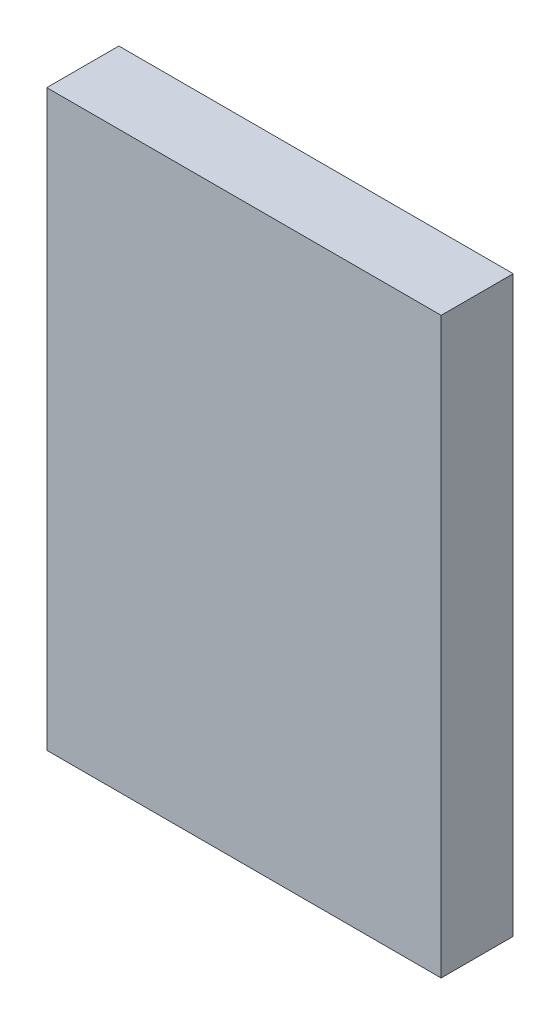
ISO-10303-21;
HEADER;
FILE_DESCRIPTION(('STEP AP214'),'2;1');
FILE_NAME('part.step','',(''),(''),'','','');
FILE_SCHEMA(('AUTOMOTIVE_DESIGN { 1 0 10303 214 1 1 1 1 }'));
ENDSEC;
DATA;
#1=APPLICATION_CONTEXT('core data for automotive mechanical design processes');
#2=APPLICATION_PROTOCOL_DEFINITION('international standard','automotive_design',2000,#1);
#3=PRODUCT_CONTEXT('',#1,'mechanical');
#4=PRODUCT('Part','Part','',(#3));
#5=PRODUCT_RELATED_PRODUCT_CATEGORY('part','',(#4));
#6=PRODUCT_DEFINITION_FORMATION('','',#4);
#7=PRODUCT_DEFINITION_CONTEXT('part definition',#1,'design');
#8=PRODUCT_DEFINITION('design','',#6,#7);
#9=PRODUCT_DEFINITION_SHAPE('','',#8);
#10=(LENGTH_UNIT() NAMED_UNIT(*) SI_UNIT(.MILLI.,.METRE.));
#11=(NAMED_UNIT(*) PLANE_ANGLE_UNIT() SI_UNIT($,.RADIAN.));
#12=(NAMED_UNIT(*) SI_UNIT($,.STERADIAN.) SOLID_ANGLE_UNIT());
#13=UNCERTAINTY_MEASURE_WITH_UNIT(LENGTH_MEASURE(1.E-05),#10,'distance_accuracy_value','');
#14=(GEOMETRIC_REPRESENTATION_CONTEXT(3) GLOBAL_UNCERTAINTY_ASSIGNED_CONTEXT((#13)) GLOBAL_UNIT_ASSIGNED_CONTEXT((#10,
#11,#12)) REPRESENTATION_CONTEXT('',''));
#15=CARTESIAN_POINT('',(0.,0.,0.));
#16=DIRECTION('',(0.,0.,1.));
#17=DIRECTION('',(1.,0.,0.));
#18=AXIS2_PLACEMENT_3D('',#15,#16,#17);
#19=CARTESIAN_POINT('',(0.775,1.143,0.));
#20=DIRECTION('',(0.,-1.,0.));
#21=DIRECTION('',(0.,0.,-1.));
#22=AXIS2_PLACEMENT_3D('',#19,#20,#21);
#23=PLANE('',#22);
#24=DIRECTION('',(-1.,0.,0.));
#25=VECTOR('',#24,1.);
#26=CARTESIAN_POINT('',(1.054,1.143,0.));
#27=LINE('',#26,#25);
#28=CARTESIAN_POINT('',(1.054,1.143,0.));
#29=VERTEX_POINT('',#28);
#30=CARTESIAN_POINT('',(0.775,1.143,0.));
#31=VERTEX_POINT('',#30);
#32=EDGE_CURVE('E11',#29,#31,#27,.T.);
#33=ORIENTED_EDGE('',*,*,#32,.F.);
#34=DIRECTION('',(0.,0.,-1.));
#35=VECTOR('',#34,1.);
#36=CARTESIAN_POINT('',(1.054,1.143,0.051));
#37=LINE('',#36,#35);
#38=CARTESIAN_POINT('',(1.054,1.143,0.051));
#39=VERTEX_POINT('',#38);
#40=EDGE_CURVE('E24',#39,#29,#37,.T.);
#41=ORIENTED_EDGE('',*,*,#40,.F.);
#42=DIRECTION('',(1.,0.,0.));
#43=VECTOR('',#42,1.);
#44=CARTESIAN_POINT('',(0.775,1.143,0.051));
#45=LINE('',#44,#43);
#46=CARTESIAN_POINT('',(0.775,1.143,0.051));
#47=VERTEX_POINT('',#46);
#48=EDGE_CURVE('E88',#47,#39,#45,.T.);
#49=ORIENTED_EDGE('',*,*,#48,.F.);
#50=DIRECTION('',(0.,0.,1.));
#51=VECTOR('',#50,1.);
#52=CARTESIAN_POINT('',(0.775,1.143,0.));
#53=LINE('',#52,#51);
#54=EDGE_CURVE('E77',#31,#47,#53,.T.);
#55=ORIENTED_EDGE('',*,*,#54,.F.);
#56=EDGE_LOOP('',(#33,#41,#49,#55));
#57=FACE_BOUND('',#56,.T.);
#58=ADVANCED_FACE('F17',(#57),#23,.T.);
#59=CARTESIAN_POINT('',(1.054,1.143,0.));
#60=DIRECTION('',(1.,0.,0.));
#61=DIRECTION('',(0.,1.,0.));
#62=AXIS2_PLACEMENT_3D('',#59,#60,#61);
#63=PLANE('',#62);
#64=DIRECTION('',(0.,-1.,0.));
#65=VECTOR('',#64,1.);
#66=CARTESIAN_POINT('',(1.054,1.549,0.));
#67=LINE('',#66,#65);
#68=CARTESIAN_POINT('',(1.054,1.549,0.));
#69=VERTEX_POINT('',#68);
#70=EDGE_CURVE('E85',#69,#29,#67,.T.);
#71=ORIENTED_EDGE('',*,*,#70,.F.);
#72=DIRECTION('',(0.,0.,-1.));
#73=VECTOR('',#72,1.);
#74=CARTESIAN_POINT('',(1.054,1.549,0.051));
#75=LINE('',#74,#73);
#76=CARTESIAN_POINT('',(1.054,1.549,0.051));
#77=VERTEX_POINT('',#76);
#78=EDGE_CURVE('E83',#77,#69,#75,.T.);
#79=ORIENTED_EDGE('',*,*,#78,.F.);
#80=DIRECTION('',(0.,1.,0.));
#81=VECTOR('',#80,1.);
#82=CARTESIAN_POINT('',(1.054,1.143,0.051));
#83=LINE('',#82,#81);
#84=EDGE_CURVE('E72',#39,#77,#83,.T.);
#85=ORIENTED_EDGE('',*,*,#84,.F.);
#86=ORIENTED_EDGE('',*,*,#40,.T.);
#87=EDGE_LOOP('',(#71,#79,#85,#86));
#88=FACE_BOUND('',#87,.T.);
#89=ADVANCED_FACE('F90',(#88),#63,.T.);
#90=CARTESIAN_POINT('',(1.054,1.549,0.));
#91=DIRECTION('',(0.,1.,0.));
#92=DIRECTION('',(1.,0.,0.));
#93=AXIS2_PLACEMENT_3D('',#90,#91,#92);
#94=PLANE('',#93);
#95=DIRECTION('',(1.,0.,0.));
#96=VECTOR('',#95,1.);
#97=CARTESIAN_POINT('',(0.775,1.549,0.));
#98=LINE('',#97,#96);
#99=CARTESIAN_POINT('',(0.775,1.549,0.));
#100=VERTEX_POINT('',#99);
#101=EDGE_CURVE('E60',#100,#69,#98,.T.);
#102=ORIENTED_EDGE('',*,*,#101,.F.);
#103=DIRECTION('',(0.,0.,-1.));
#104=VECTOR('',#103,1.);
#105=CARTESIAN_POINT('',(0.775,1.549,0.051));
#106=LINE('',#105,#104);
#107=CARTESIAN_POINT('',(0.775,1.549,0.051));
#108=VERTEX_POINT('',#107);
#109=EDGE_CURVE('E54',#108,#100,#106,.T.);
#110=ORIENTED_EDGE('',*,*,#109,.F.);
#111=DIRECTION('',(-1.,0.,0.));
#112=VECTOR('',#111,1.);
#113=CARTESIAN_POINT('',(1.054,1.549,0.051));
#114=LINE('',#113,#112);
#115=EDGE_CURVE('E58',#77,#108,#114,.T.);
#116=ORIENTED_EDGE('',*,*,#115,.F.);
#117=ORIENTED_EDGE('',*,*,#78,.T.);
#118=EDGE_LOOP('',(#102,#110,#116,#117));
#119=FACE_BOUND('',#118,.T.);
#120=ADVANCED_FACE('F56',(#119),#94,.T.);
#121=CARTESIAN_POINT('',(0.775,1.549,0.));
#122=DIRECTION('',(-1.,0.,0.));
#123=DIRECTION('',(0.,0.,1.));
#124=AXIS2_PLACEMENT_3D('',#121,#122,#123);
#125=PLANE('',#124);
#126=DIRECTION('',(0.,1.,0.));
#127=VECTOR('',#126,1.);
#128=CARTESIAN_POINT('',(0.775,1.143,0.));
#129=LINE('',#128,#127);
#130=EDGE_CURVE('E73',#31,#100,#129,.T.);
#131=ORIENTED_EDGE('',*,*,#130,.F.);
#132=ORIENTED_EDGE('',*,*,#54,.T.);
#133=DIRECTION('',(0.,-1.,0.));
#134=VECTOR('',#133,1.);
#135=CARTESIAN_POINT('',(0.775,1.549,0.051));
#136=LINE('',#135,#134);
#137=EDGE_CURVE('E70',#108,#47,#136,.T.);
#138=ORIENTED_EDGE('',*,*,#137,.F.);
#139=ORIENTED_EDGE('',*,*,#109,.T.);
#140=EDGE_LOOP('',(#131,#132,#138,#139));
#141=FACE_BOUND('',#140,.T.);
#142=ADVANCED_FACE('F76',(#141),#125,.T.);
#143=CARTESIAN_POINT('',(0.775,1.549,0.));
#144=DIRECTION('',(0.,0.,-1.));
#145=DIRECTION('',(0.,-1.,0.));
#146=AXIS2_PLACEMENT_3D('',#143,#144,#145);
#147=PLANE('',#146);
#148=ORIENTED_EDGE('',*,*,#101,.T.);
#149=ORIENTED_EDGE('',*,*,#70,.T.);
#150=ORIENTED_EDGE('',*,*,#32,.T.);
#151=ORIENTED_EDGE('',*,*,#130,.T.);
#152=EDGE_LOOP('',(#148,#149,#150,#151));
#153=FACE_BOUND('',#152,.T.);
#154=ADVANCED_FACE('F91',(#153),#147,.T.);
#155=CARTESIAN_POINT('',(0.775,1.143,0.051));
#156=DIRECTION('',(0.,0.,1.));
#157=DIRECTION('',(1.,0.,0.));
#158=AXIS2_PLACEMENT_3D('',#155,#156,#157);
#159=PLANE('',#158);
#160=ORIENTED_EDGE('',*,*,#48,.T.);
#161=ORIENTED_EDGE('',*,*,#84,.T.);
#162=ORIENTED_EDGE('',*,*,#115,.T.);
#163=ORIENTED_EDGE('',*,*,#137,.T.);
#164=EDGE_LOOP('',(#160,#161,#162,#163));
#165=FACE_BOUND('',#164,.T.);
#166=ADVANCED_FACE('F69',(#165),#159,.T.);
#167=CLOSED_SHELL('',(#58,#89,#120,#142,#154,#166));
#168=MANIFOLD_SOLID_BREP('B1',#167);
#169=ADVANCED_BREP_SHAPE_REPRESENTATION('',(#18,#168),#14);
#170=SHAPE_DEFINITION_REPRESENTATION(#9,#169);
ENDSEC;
END-ISO-10303-21;
